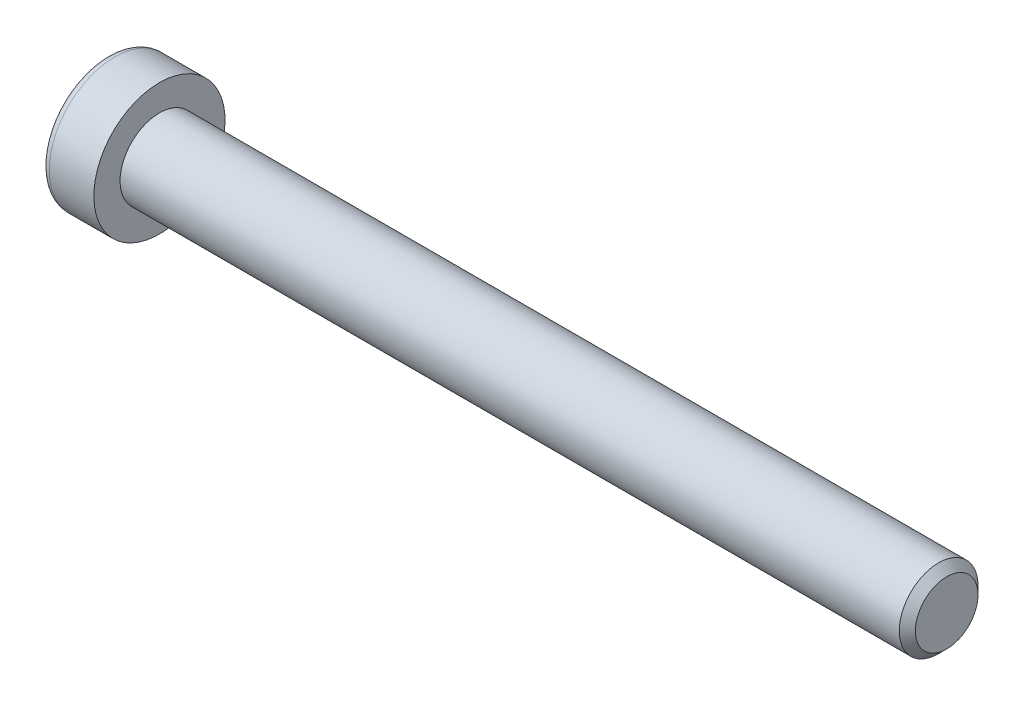
ISO-10303-21;
HEADER;
FILE_DESCRIPTION(('STEP AP214'),'2;1');
FILE_NAME('part.step','',(''),(''),'','','');
FILE_SCHEMA(('AUTOMOTIVE_DESIGN { 1 0 10303 214 1 1 1 1 }'));
ENDSEC;
DATA;
#1=APPLICATION_CONTEXT('core data for automotive mechanical design processes');
#2=APPLICATION_PROTOCOL_DEFINITION('international standard','automotive_design',2000,#1);
#3=PRODUCT_CONTEXT('',#1,'mechanical');
#4=PRODUCT('Part','Part','',(#3));
#5=PRODUCT_RELATED_PRODUCT_CATEGORY('part','',(#4));
#6=PRODUCT_DEFINITION_FORMATION('','',#4);
#7=PRODUCT_DEFINITION_CONTEXT('part definition',#1,'design');
#8=PRODUCT_DEFINITION('design','',#6,#7);
#9=PRODUCT_DEFINITION_SHAPE('','',#8);
#10=(LENGTH_UNIT() NAMED_UNIT(*) SI_UNIT(.MILLI.,.METRE.));
#11=(NAMED_UNIT(*) PLANE_ANGLE_UNIT() SI_UNIT($,.RADIAN.));
#12=(NAMED_UNIT(*) SI_UNIT($,.STERADIAN.) SOLID_ANGLE_UNIT());
#13=UNCERTAINTY_MEASURE_WITH_UNIT(LENGTH_MEASURE(1.E-05),#10,'distance_accuracy_value','');
#14=(GEOMETRIC_REPRESENTATION_CONTEXT(3) GLOBAL_UNCERTAINTY_ASSIGNED_CONTEXT((#13)) GLOBAL_UNIT_ASSIGNED_CONTEXT((#10,
#11,#12)) REPRESENTATION_CONTEXT('',''));
#15=CARTESIAN_POINT('',(0.,0.,0.));
#16=DIRECTION('',(0.,0.,1.));
#17=DIRECTION('',(1.,0.,0.));
#18=AXIS2_PLACEMENT_3D('',#15,#16,#17);
#19=CARTESIAN_POINT('',(-1.0080000013204,0.,0.));
#20=DIRECTION('',(-1.,0.,0.));
#21=DIRECTION('',(0.,0.,1.));
#22=AXIS2_PLACEMENT_3D('',#19,#20,#21);
#23=CONICAL_SURFACE('',#22,2.32325748231688,1.04719754987444);
#24=CARTESIAN_POINT('',(0.333333335277075,-1.13686837721616E-10,0.));
#25=VERTEX_POINT('',#24);
#26=VERTEX_LOOP('',#25);
#27=FACE_BOUND('',#26,.T.);
#28=CARTESIAN_POINT('',(-1.00000000147417,2.00000000033577,1.15470053795369));
#29=CARTESIAN_POINT('',(-0.970695546651424,2.00000000012059,1.05321634683343));
#30=CARTESIAN_POINT('',(-0.944044678605912,2.00000000003232,0.950856145634243));
#31=CARTESIAN_POINT('',(-0.89752638882102,1.9999999999676,0.744363444828041));
#32=CARTESIAN_POINT('',(-0.877675421693126,1.99999999999142,0.640227277439652));
#33=CARTESIAN_POINT('',(-0.846775960221252,2.00000000000837,0.433245449982703));
#34=CARTESIAN_POINT('',(-0.835521788855821,2.00000000000223,0.330431627800687));
#35=CARTESIAN_POINT('',(-0.822089169383493,1.99999999999777,0.124320462828436));
#36=CARTESIAN_POINT('',(-0.819899595237444,1.99999999999944,0.0210238686822163));
#37=CARTESIAN_POINT('',(-0.824466291464269,2.00000000000049,-0.171974735991148));
#38=CARTESIAN_POINT('',(-0.830101286550578,2.00000000000013,-0.261705707531802));
#39=CARTESIAN_POINT('',(-0.847957302108121,1.99999999999987,-0.440583082600117));
#40=CARTESIAN_POINT('',(-0.860184416189506,1.99999999999996,-0.529728867900473));
#41=CARTESIAN_POINT('',(-0.890749834827568,2.00000000000004,-0.70897474722998));
#42=CARTESIAN_POINT('',(-0.909217643745651,2.00000000000002,-0.799052166718215));
#43=CARTESIAN_POINT('',(-0.951131762446776,1.99999999999998,-0.977863889549757));
#44=CARTESIAN_POINT('',(-0.974568230401505,1.99999999999996,-1.06660048191082));
#45=CARTESIAN_POINT('',(-1.0000000016925,2.,-1.15470053794852));
#46=B_SPLINE_CURVE_WITH_KNOTS('',3,(#28,#29,#30,#31,#32,#33,#34,#35,#36,#37,#38,#39,#40,#41,#42,
#43,#44,#45),.UNSPECIFIED.,.F.,.F.,(4,2,2,2,2,2,2,2,4),(0.,0.317016011625951,0.634793817177001,
0.944707606346165,1.25424088912896,1.52370778261223,1.7934241935265,2.06912162198924,
2.3442779727795),.UNSPECIFIED.);
#47=CARTESIAN_POINT('',(-1.00000000167708,1.99999999979036,1.15470053825821));
#48=VERTEX_POINT('',#47);
#49=CARTESIAN_POINT('',(-1.00000000174696,2.,-1.15470053813718));
#50=VERTEX_POINT('',#49);
#51=EDGE_CURVE('E18',#48,#50,#46,.T.);
#52=ORIENTED_EDGE('',*,*,#51,.T.);
#53=CARTESIAN_POINT('',(-1.00000000147417,1.99999999979934,-1.15470053888282));
#54=CARTESIAN_POINT('',(-0.970695546651423,1.91211211209909,-1.2054426342566));
#55=CARTESIAN_POINT('',(-0.944044678605912,1.82346557747997,-1.25662273477975));
#56=CARTESIAN_POINT('',(-0.89752638882102,1.64463765285338,-1.3598690851268));
#57=CARTESIAN_POINT('',(-0.877675421693125,1.5544530864542,-1.41193716884162));
#58=CARTESIAN_POINT('',(-0.846775960221251,1.37520156576323,-1.51542808258477));
#59=CARTESIAN_POINT('',(-0.83552178885582,1.28616218389036,-1.56683499367046));
#60=CARTESIAN_POINT('',(-0.822089169383492,1.10766467901855,-1.66989057615273));
#61=CARTESIAN_POINT('',(-0.819899595237443,1.01820720436435,-1.72153887322728));
#62=CARTESIAN_POINT('',(-0.824466291464268,0.851065509822789,-1.81803817556487));
#63=CARTESIAN_POINT('',(-0.830101286550577,0.773356208962147,-1.86290366133489));
#64=CARTESIAN_POINT('',(-0.84795730210812,0.618443857990577,-1.95234234886882));
#65=CARTESIAN_POINT('',(-0.860184416189505,0.541241343280201,-1.99691524151908));
#66=CARTESIAN_POINT('',(-0.890749834827567,0.386009858257207,-2.0865381811839));
#67=CARTESIAN_POINT('',(-0.90921764374565,0.308000524673037,-2.131576890928));
#68=CARTESIAN_POINT('',(-0.951131762446774,0.153145030206441,-2.22098275234374));
#69=CARTESIAN_POINT('',(-0.974568230401503,0.0762968869764867,-2.26535104852425));
#70=CARTESIAN_POINT('',(-1.0000000016925,3.73024698366476E-10,-2.30940107654314));
#71=B_SPLINE_CURVE_WITH_KNOTS('',3,(#53,#54,#55,#56,#57,#58,#59,#60,#61,#62,#63,#64,#65,#66,#67,
#68,#69,#70),.UNSPECIFIED.,.F.,.F.,(4,2,2,2,2,2,2,2,4),(0.,0.317016011625951,0.634793817177,
0.944707606346164,1.25424088912896,1.52370778261223,1.7934241935265,2.06912162198924,
2.3442779727795),.UNSPECIFIED.);
#72=CARTESIAN_POINT('',(-1.00000000167708,0.,-2.30940107651643));
#73=VERTEX_POINT('',#72);
#74=EDGE_CURVE('E78',#50,#73,#71,.T.);
#75=ORIENTED_EDGE('',*,*,#74,.T.);
#76=CARTESIAN_POINT('',(-1.00000000147417,-5.3643055377186E-10,-2.30940107683651));
#77=CARTESIAN_POINT('',(-0.970695546651424,-0.0878878880215004,-2.25865898109003));
#78=CARTESIAN_POINT('',(-0.944044678605912,-0.176534422552348,-2.20747888041399));
#79=CARTESIAN_POINT('',(-0.89752638882102,-0.355362347114219,-2.10423252995484));
#80=CARTESIAN_POINT('',(-0.877675421693126,-0.445546913537223,-2.05216444628128));
#81=CARTESIAN_POINT('',(-0.846775960221251,-0.624798434245139,-1.94867353256747));
#82=CARTESIAN_POINT('',(-0.83552178885582,-0.713837816111874,-1.89726662147115));
#83=CARTESIAN_POINT('',(-0.822089169383492,-0.89233532097922,-1.79421103898117));
#84=CARTESIAN_POINT('',(-0.819899595237443,-0.981792795635091,-1.7425627419095));
#85=CARTESIAN_POINT('',(-0.824466291464268,-1.1489344901777,-1.64606343957373));
#86=CARTESIAN_POINT('',(-0.830101286550577,-1.22664379103798,-1.60119795380309));
#87=CARTESIAN_POINT('',(-0.84795730210812,-1.38155614200929,-1.51175926626871));
#88=CARTESIAN_POINT('',(-0.860184416189505,-1.45875865671976,-1.46718637361861));
#89=CARTESIAN_POINT('',(-0.890749834827567,-1.61399014174283,-1.37756343395392));
#90=CARTESIAN_POINT('',(-0.90921764374565,-1.69199947532698,-1.33252472420979));
#91=CARTESIAN_POINT('',(-0.951131762446775,-1.84685496979354,-1.24311886279398));
#92=CARTESIAN_POINT('',(-0.974568230401503,-1.92370311302347,-1.19875056661343));
#93=CARTESIAN_POINT('',(-1.0000000016925,-1.99999999962697,-1.15470053859462));
#94=B_SPLINE_CURVE_WITH_KNOTS('',3,(#76,#77,#78,#79,#80,#81,#82,#83,#84,#85,#86,#87,#88,#89,#90,
#91,#92,#93),.UNSPECIFIED.,.F.,.F.,(4,2,2,2,2,2,2,2,4),(0.,0.317016011625951,0.634793817177001,
0.944707606346165,1.25424088912896,1.52370778261223,1.7934241935265,2.06912162198924,
2.3442779727795),.UNSPECIFIED.);
#95=CARTESIAN_POINT('',(-1.00000000167708,-1.99999999979036,-1.15470053825822));
#96=VERTEX_POINT('',#95);
#97=EDGE_CURVE('E103',#73,#96,#94,.T.);
#98=ORIENTED_EDGE('',*,*,#97,.T.);
#99=CARTESIAN_POINT('',(-1.00000000147417,-2.00000000033577,-1.15470053795369));
#100=CARTESIAN_POINT('',(-0.970695546651424,-2.00000000012059,-1.05321634683343));
#101=CARTESIAN_POINT('',(-0.944044678605912,-2.00000000003232,-0.950856145634245));
#102=CARTESIAN_POINT('',(-0.89752638882102,-1.9999999999676,-0.744363444828043));
#103=CARTESIAN_POINT('',(-0.877675421693126,-1.99999999999142,-0.640227277439654));
#104=CARTESIAN_POINT('',(-0.846775960221251,-2.00000000000836,-0.433245449982705));
#105=CARTESIAN_POINT('',(-0.83552178885582,-2.00000000000223,-0.330431627800689));
#106=CARTESIAN_POINT('',(-0.822089169383492,-1.99999999999777,-0.124320462828438));
#107=CARTESIAN_POINT('',(-0.819899595237443,-1.99999999999944,-0.0210238686822187));
#108=CARTESIAN_POINT('',(-0.824466291464268,-2.00000000000049,0.171974735991145));
#109=CARTESIAN_POINT('',(-0.830101286550578,-2.00000000000013,0.261705707531799));
#110=CARTESIAN_POINT('',(-0.84795730210812,-1.99999999999987,0.440583082600114));
#111=CARTESIAN_POINT('',(-0.860184416189505,-1.99999999999996,0.529728867900471));
#112=CARTESIAN_POINT('',(-0.890749834827567,-2.00000000000004,0.708974747229978));
#113=CARTESIAN_POINT('',(-0.90921764374565,-2.00000000000002,0.799052166718213));
#114=CARTESIAN_POINT('',(-0.951131762446775,-1.99999999999998,0.977863889549755));
#115=CARTESIAN_POINT('',(-0.974568230401504,-1.99999999999996,1.06660048191082));
#116=CARTESIAN_POINT('',(-1.0000000016925,-2.,1.15470053794852));
#117=B_SPLINE_CURVE_WITH_KNOTS('',3,(#99,#100,#101,#102,#103,#104,#105,#106,#107,#108,#109,#110,
#111,#112,#113,#114,#115,#116),.UNSPECIFIED.,.F.,.F.,(4,2,2,2,2,2,2,2,4),(0.,0.317016011625951,
0.634793817177001,0.944707606346165,1.25424088912896,1.52370778261223,1.7934241935265,
2.06912162198924,2.3442779727795),.UNSPECIFIED.);
#118=CARTESIAN_POINT('',(-1.00000000167708,-1.99999999979036,1.15470053825822));
#119=VERTEX_POINT('',#118);
#120=EDGE_CURVE('E127',#96,#119,#117,.T.);
#121=ORIENTED_EDGE('',*,*,#120,.T.);
#122=CARTESIAN_POINT('',(-1.00000000147417,-1.99999999979934,1.15470053888282));
#123=CARTESIAN_POINT('',(-0.970695546651424,-1.91211211209909,1.2054426342566));
#124=CARTESIAN_POINT('',(-0.944044678605912,-1.82346557747997,1.25662273477974));
#125=CARTESIAN_POINT('',(-0.89752638882102,-1.64463765285338,1.3598690851268));
#126=CARTESIAN_POINT('',(-0.877675421693125,-1.5544530864542,1.41193716884162));
#127=CARTESIAN_POINT('',(-0.846775960221251,-1.37520156576323,1.51542808258477));
#128=CARTESIAN_POINT('',(-0.83552178885582,-1.28616218389036,1.56683499367046));
#129=CARTESIAN_POINT('',(-0.822089169383492,-1.10766467901855,1.66989057615273));
#130=CARTESIAN_POINT('',(-0.819899595237443,-1.01820720436435,1.72153887322728));
#131=CARTESIAN_POINT('',(-0.824466291464268,-0.85106550982279,1.81803817556487));
#132=CARTESIAN_POINT('',(-0.830101286550577,-0.773356208962147,1.86290366133489));
#133=CARTESIAN_POINT('',(-0.84795730210812,-0.618443857990578,1.95234234886882));
#134=CARTESIAN_POINT('',(-0.860184416189505,-0.541241343280202,1.99691524151908));
#135=CARTESIAN_POINT('',(-0.890749834827567,-0.386009858257207,2.0865381811839));
#136=CARTESIAN_POINT('',(-0.90921764374565,-0.308000524673038,2.131576890928));
#137=CARTESIAN_POINT('',(-0.951131762446775,-0.153145030206442,2.22098275234374));
#138=CARTESIAN_POINT('',(-0.974568230401503,-0.0762968869764879,2.26535104852425));
#139=CARTESIAN_POINT('',(-1.0000000016925,-3.73025682950192E-10,2.30940107654314));
#140=B_SPLINE_CURVE_WITH_KNOTS('',3,(#122,#123,#124,#125,#126,#127,#128,#129,#130,#131,#132,
#133,#134,#135,#136,#137,#138,#139),.UNSPECIFIED.,.F.,.F.,(4,2,2,2,2,2,2,2,4),(0.,
0.317016011625951,0.634793817177001,0.944707606346165,1.25424088912896,1.52370778261223,
1.7934241935265,2.06912162198924,2.3442779727795),.UNSPECIFIED.);
#141=CARTESIAN_POINT('',(-1.00000000167708,0.,2.30940107651643));
#142=VERTEX_POINT('',#141);
#143=EDGE_CURVE('E135',#119,#142,#140,.T.);
#144=ORIENTED_EDGE('',*,*,#143,.T.);
#145=CARTESIAN_POINT('',(-1.00000000147417,5.36430323683261E-10,2.30940107683651));
#146=CARTESIAN_POINT('',(-0.970695546651424,0.0878878880215003,2.25865898109003));
#147=CARTESIAN_POINT('',(-0.944044678605912,0.176534422552348,2.20747888041399));
#148=CARTESIAN_POINT('',(-0.89752638882102,0.355362347114218,2.10423252995484));
#149=CARTESIAN_POINT('',(-0.877675421693125,0.445546913537223,2.05216444628128));
#150=CARTESIAN_POINT('',(-0.846775960221251,0.624798434245139,1.94867353256747));
#151=CARTESIAN_POINT('',(-0.83552178885582,0.713837816111873,1.89726662147115));
#152=CARTESIAN_POINT('',(-0.822089169383491,0.892335320979219,1.79421103898117));
#153=CARTESIAN_POINT('',(-0.819899595237443,0.98179279563509,1.7425627419095));
#154=CARTESIAN_POINT('',(-0.824466291464268,1.1489344901777,1.64606343957372));
#155=CARTESIAN_POINT('',(-0.830101286550577,1.22664379103798,1.60119795380309));
#156=CARTESIAN_POINT('',(-0.847957302108119,1.38155614200929,1.5117592662687));
#157=CARTESIAN_POINT('',(-0.860184416189504,1.45875865671976,1.46718637361861));
#158=CARTESIAN_POINT('',(-0.890749834827566,1.61399014174283,1.37756343395392));
#159=CARTESIAN_POINT('',(-0.909217643745649,1.69199947532698,1.33252472420978));
#160=CARTESIAN_POINT('',(-0.951131762446774,1.84685496979354,1.24311886279398));
#161=CARTESIAN_POINT('',(-0.974568230401503,1.92370311302347,1.19875056661343));
#162=CARTESIAN_POINT('',(-1.0000000016925,1.99999999962697,1.15470053859461));
#163=B_SPLINE_CURVE_WITH_KNOTS('',3,(#145,#146,#147,#148,#149,#150,#151,#152,#153,#154,#155,
#156,#157,#158,#159,#160,#161,#162),.UNSPECIFIED.,.F.,.F.,(4,2,2,2,2,2,2,2,4),(0.,
0.317016011625951,0.634793817177001,0.944707606346165,1.25424088912896,1.52370778261223,
1.7934241935265,2.06912162198924,2.3442779727795),.UNSPECIFIED.);
#164=EDGE_CURVE('E80',#142,#48,#163,.T.);
#165=ORIENTED_EDGE('',*,*,#164,.T.);
#166=EDGE_LOOP('',(#52,#75,#98,#121,#144,#165));
#167=FACE_BOUND('',#166,.T.);
#168=ADVANCED_FACE('F14',(#27,#167),#23,.F.);
#169=CARTESIAN_POINT('',(-3.99999999999999,2.,1.15470053837925));
#170=DIRECTION('',(0.,1.,0.));
#171=DIRECTION('',(0.,0.,1.));
#172=AXIS2_PLACEMENT_3D('',#169,#170,#171);
#173=PLANE('',#172);
#174=DIRECTION('',(1.,0.,0.));
#175=VECTOR('',#174,1.);
#176=CARTESIAN_POINT('',(-3.99999999999999,2.,1.15470053837925));
#177=LINE('',#176,#175);
#178=CARTESIAN_POINT('',(-3.99999999999999,2.,1.15470053837925));
#179=VERTEX_POINT('',#178);
#180=EDGE_CURVE('E82',#48,#179,#177,.F.);
#181=ORIENTED_EDGE('',*,*,#180,.T.);
#182=DIRECTION('',(0.,0.,1.));
#183=VECTOR('',#182,1.);
#184=CARTESIAN_POINT('',(-3.99999999999999,2.,0.));
#185=LINE('',#184,#183);
#186=CARTESIAN_POINT('',(-3.99999999999999,2.,-1.15470053837925));
#187=VERTEX_POINT('',#186);
#188=EDGE_CURVE('E87',#187,#179,#185,.T.);
#189=ORIENTED_EDGE('',*,*,#188,.F.);
#190=DIRECTION('',(1.,0.,0.));
#191=VECTOR('',#190,1.);
#192=CARTESIAN_POINT('',(-3.99999999999999,2.,-1.15470053837925));
#193=LINE('',#192,#191);
#194=EDGE_CURVE('E85',#187,#50,#193,.T.);
#195=ORIENTED_EDGE('',*,*,#194,.T.);
#196=ORIENTED_EDGE('',*,*,#51,.F.);
#197=EDGE_LOOP('',(#181,#189,#195,#196));
#198=FACE_BOUND('',#197,.T.);
#199=ADVANCED_FACE('F74',(#198),#173,.F.);
#200=CARTESIAN_POINT('',(-3.99999999999999,0.,2.3094010767585));
#201=DIRECTION('',(0.,0.500000000000001,0.866025403784438));
#202=DIRECTION('',(0.,-0.866025403784438,0.500000000000001));
#203=AXIS2_PLACEMENT_3D('',#200,#201,#202);
#204=PLANE('',#203);
#205=DIRECTION('',(1.,0.,0.));
#206=VECTOR('',#205,1.);
#207=CARTESIAN_POINT('',(-3.99999999999999,0.,2.3094010767585));
#208=LINE('',#207,#206);
#209=CARTESIAN_POINT('',(-3.99999999999999,0.,2.3094010767585));
#210=VERTEX_POINT('',#209);
#211=EDGE_CURVE('E139',#142,#210,#208,.F.);
#212=ORIENTED_EDGE('',*,*,#211,.T.);
#213=DIRECTION('',(0.,-0.866025403784438,0.500000000000001));
#214=VECTOR('',#213,1.);
#215=CARTESIAN_POINT('',(-3.99999999999999,2.,1.15470053837925));
#216=LINE('',#215,#214);
#217=EDGE_CURVE('E93',#179,#210,#216,.T.);
#218=ORIENTED_EDGE('',*,*,#217,.F.);
#219=ORIENTED_EDGE('',*,*,#180,.F.);
#220=ORIENTED_EDGE('',*,*,#164,.F.);
#221=EDGE_LOOP('',(#212,#218,#219,#220));
#222=FACE_BOUND('',#221,.T.);
#223=ADVANCED_FACE('F143',(#222),#204,.F.);
#224=CARTESIAN_POINT('',(-3.99999999999999,-2.,1.15470053837925));
#225=DIRECTION('',(0.,-0.5,0.866025403784439));
#226=DIRECTION('',(0.,-0.866025403784439,-0.5));
#227=AXIS2_PLACEMENT_3D('',#224,#225,#226);
#228=PLANE('',#227);
#229=DIRECTION('',(1.,0.,0.));
#230=VECTOR('',#229,1.);
#231=CARTESIAN_POINT('',(-3.99999999999999,-2.,1.15470053837925));
#232=LINE('',#231,#230);
#233=CARTESIAN_POINT('',(-3.99999999999999,-2.,1.15470053837925));
#234=VERTEX_POINT('',#233);
#235=EDGE_CURVE('E134',#119,#234,#232,.F.);
#236=ORIENTED_EDGE('',*,*,#235,.T.);
#237=DIRECTION('',(0.,-0.866025403784439,-0.5));
#238=VECTOR('',#237,1.);
#239=CARTESIAN_POINT('',(-3.99999999999999,0.,2.3094010767585));
#240=LINE('',#239,#238);
#241=EDGE_CURVE('E222',#210,#234,#240,.T.);
#242=ORIENTED_EDGE('',*,*,#241,.F.);
#243=ORIENTED_EDGE('',*,*,#211,.F.);
#244=ORIENTED_EDGE('',*,*,#143,.F.);
#245=EDGE_LOOP('',(#236,#242,#243,#244));
#246=FACE_BOUND('',#245,.T.);
#247=ADVANCED_FACE('F123',(#246),#228,.F.);
#248=CARTESIAN_POINT('',(-3.99999999999999,-2.,-1.15470053837925));
#249=DIRECTION('',(0.,-1.,0.));
#250=DIRECTION('',(0.,0.,-1.));
#251=AXIS2_PLACEMENT_3D('',#248,#249,#250);
#252=PLANE('',#251);
#253=DIRECTION('',(1.,0.,0.));
#254=VECTOR('',#253,1.);
#255=CARTESIAN_POINT('',(-3.99999999999999,-2.,-1.15470053837925));
#256=LINE('',#255,#254);
#257=CARTESIAN_POINT('',(-3.99999999999999,-2.,-1.15470053837925));
#258=VERTEX_POINT('',#257);
#259=EDGE_CURVE('E133',#96,#258,#256,.F.);
#260=ORIENTED_EDGE('',*,*,#259,.T.);
#261=DIRECTION('',(0.,0.,1.));
#262=VECTOR('',#261,1.);
#263=CARTESIAN_POINT('',(-3.99999999999999,-2.,0.));
#264=LINE('',#263,#262);
#265=EDGE_CURVE('E219',#234,#258,#264,.F.);
#266=ORIENTED_EDGE('',*,*,#265,.F.);
#267=ORIENTED_EDGE('',*,*,#235,.F.);
#268=ORIENTED_EDGE('',*,*,#120,.F.);
#269=EDGE_LOOP('',(#260,#266,#267,#268));
#270=FACE_BOUND('',#269,.T.);
#271=ADVANCED_FACE('F119',(#270),#252,.F.);
#272=CARTESIAN_POINT('',(-3.99999999999999,0.,-2.3094010767585));
#273=DIRECTION('',(0.,-0.5,-0.866025403784438));
#274=DIRECTION('',(0.,0.866025403784438,-0.5));
#275=AXIS2_PLACEMENT_3D('',#272,#273,#274);
#276=PLANE('',#275);
#277=DIRECTION('',(1.,0.,0.));
#278=VECTOR('',#277,1.);
#279=CARTESIAN_POINT('',(-3.99999999999999,0.,-2.3094010767585));
#280=LINE('',#279,#278);
#281=CARTESIAN_POINT('',(-3.99999999999999,0.,-2.3094010767585));
#282=VERTEX_POINT('',#281);
#283=EDGE_CURVE('E36',#73,#282,#280,.F.);
#284=ORIENTED_EDGE('',*,*,#283,.T.);
#285=DIRECTION('',(0.,0.866025403784438,-0.5));
#286=VECTOR('',#285,1.);
#287=CARTESIAN_POINT('',(-3.99999999999999,-2.,-1.15470053837925));
#288=LINE('',#287,#286);
#289=EDGE_CURVE('E216',#258,#282,#288,.T.);
#290=ORIENTED_EDGE('',*,*,#289,.F.);
#291=ORIENTED_EDGE('',*,*,#259,.F.);
#292=ORIENTED_EDGE('',*,*,#97,.F.);
#293=EDGE_LOOP('',(#284,#290,#291,#292));
#294=FACE_BOUND('',#293,.T.);
#295=ADVANCED_FACE('F113',(#294),#276,.F.);
#296=CARTESIAN_POINT('',(-3.99999999999999,2.,-1.15470053837925));
#297=DIRECTION('',(0.,0.5,-0.866025403784439));
#298=DIRECTION('',(0.,0.866025403784439,0.5));
#299=AXIS2_PLACEMENT_3D('',#296,#297,#298);
#300=PLANE('',#299);
#301=ORIENTED_EDGE('',*,*,#194,.F.);
#302=DIRECTION('',(0.,0.866025403784439,0.5));
#303=VECTOR('',#302,1.);
#304=CARTESIAN_POINT('',(-3.99999999999999,0.,-2.3094010767585));
#305=LINE('',#304,#303);
#306=EDGE_CURVE('E214',#282,#187,#305,.T.);
#307=ORIENTED_EDGE('',*,*,#306,.F.);
#308=ORIENTED_EDGE('',*,*,#283,.F.);
#309=ORIENTED_EDGE('',*,*,#74,.F.);
#310=EDGE_LOOP('',(#301,#307,#308,#309));
#311=FACE_BOUND('',#310,.T.);
#312=ADVANCED_FACE('F91',(#311),#300,.F.);
#313=CARTESIAN_POINT('',(-3.99999999999999,3.65470053837925,0.));
#314=DIRECTION('',(-1.,0.,0.));
#315=DIRECTION('',(0.,0.,1.));
#316=AXIS2_PLACEMENT_3D('',#313,#314,#315);
#317=PLANE('',#316);
#318=ORIENTED_EDGE('',*,*,#289,.T.);
#319=ORIENTED_EDGE('',*,*,#306,.T.);
#320=ORIENTED_EDGE('',*,*,#188,.T.);
#321=ORIENTED_EDGE('',*,*,#217,.T.);
#322=ORIENTED_EDGE('',*,*,#241,.T.);
#323=ORIENTED_EDGE('',*,*,#265,.T.);
#324=EDGE_LOOP('',(#318,#319,#320,#321,#322,#323));
#325=FACE_BOUND('',#324,.T.);
#326=CARTESIAN_POINT('',(-3.99999999999999,0.,0.));
#327=DIRECTION('',(1.,0.,0.));
#328=DIRECTION('',(0.,1.,0.));
#329=AXIS2_PLACEMENT_3D('',#326,#327,#328);
#330=CIRCLE('',#329,4.4);
#331=CARTESIAN_POINT('',(-3.99999999999999,4.4,0.));
#332=VERTEX_POINT('',#331);
#333=EDGE_CURVE('E191',#332,#332,#330,.T.);
#334=ORIENTED_EDGE('',*,*,#333,.F.);
#335=EDGE_LOOP('',(#334));
#336=FACE_BOUND('',#335,.T.);
#337=ADVANCED_FACE('F112',(#325,#336),#317,.T.);
#338=CARTESIAN_POINT('',(-3.4,0.,0.));
#339=DIRECTION('',(1.,0.,0.));
#340=DIRECTION('',(0.,0.,-1.));
#341=AXIS2_PLACEMENT_3D('',#338,#339,#340);
#342=TOROIDAL_SURFACE('',#341,4.4,0.6);
#343=CARTESIAN_POINT('',(-3.4,0.,0.));
#344=DIRECTION('',(1.,0.,0.));
#345=DIRECTION('',(0.,1.,0.));
#346=AXIS2_PLACEMENT_3D('',#343,#344,#345);
#347=CIRCLE('',#346,5.);
#348=CARTESIAN_POINT('',(-3.4,5.,0.));
#349=VERTEX_POINT('',#348);
#350=EDGE_CURVE('E232',#349,#349,#347,.T.);
#351=ORIENTED_EDGE('',*,*,#350,.F.);
#352=EDGE_LOOP('',(#351));
#353=FACE_BOUND('',#352,.T.);
#354=ORIENTED_EDGE('',*,*,#333,.T.);
#355=EDGE_LOOP('',(#354));
#356=FACE_BOUND('',#355,.T.);
#357=ADVANCED_FACE('F175',(#353,#356),#342,.T.);
#358=CARTESIAN_POINT('',(-1.99999999999999,0.,0.));
#359=DIRECTION('',(1.,0.,0.));
#360=DIRECTION('',(0.,1.,0.));
#361=AXIS2_PLACEMENT_3D('',#358,#359,#360);
#362=CYLINDRICAL_SURFACE('',#361,5.);
#363=ORIENTED_EDGE('',*,*,#350,.T.);
#364=EDGE_LOOP('',(#363));
#365=FACE_BOUND('',#364,.T.);
#366=CARTESIAN_POINT('',(0.,0.,0.));
#367=DIRECTION('',(1.,0.,0.));
#368=DIRECTION('',(0.,1.,0.));
#369=AXIS2_PLACEMENT_3D('',#366,#367,#368);
#370=CIRCLE('',#369,5.);
#371=CARTESIAN_POINT('',(0.,5.,0.));
#372=VERTEX_POINT('',#371);
#373=EDGE_CURVE('E101',#372,#372,#370,.T.);
#374=ORIENTED_EDGE('',*,*,#373,.F.);
#375=EDGE_LOOP('',(#374));
#376=FACE_BOUND('',#375,.T.);
#377=ADVANCED_FACE('F172',(#365,#376),#362,.T.);
#378=CARTESIAN_POINT('',(60.,1.5,0.));
#379=DIRECTION('',(1.,0.,0.));
#380=DIRECTION('',(0.,0.,-1.));
#381=AXIS2_PLACEMENT_3D('',#378,#379,#380);
#382=PLANE('',#381);
#383=CARTESIAN_POINT('',(60.0000000002296,0.,0.));
#384=DIRECTION('',(-1.,0.,0.));
#385=DIRECTION('',(0.,0.,1.));
#386=AXIS2_PLACEMENT_3D('',#383,#384,#385);
#387=CIRCLE('',#386,2.38655000026711);
#388=CARTESIAN_POINT('',(60.0000000002296,0.,2.38655000026711));
#389=VERTEX_POINT('',#388);
#390=EDGE_CURVE('E228',#389,#389,#387,.T.);
#391=ORIENTED_EDGE('',*,*,#390,.F.);
#392=EDGE_LOOP('',(#391));
#393=FACE_BOUND('',#392,.T.);
#394=ADVANCED_FACE('F168',(#393),#382,.T.);
#395=CARTESIAN_POINT('',(0.,4.,0.));
#396=DIRECTION('',(1.,0.,0.));
#397=DIRECTION('',(0.,0.,-1.));
#398=AXIS2_PLACEMENT_3D('',#395,#396,#397);
#399=PLANE('',#398);
#400=CARTESIAN_POINT('',(0.,0.,0.));
#401=DIRECTION('',(1.,0.,0.));
#402=DIRECTION('',(0.,1.,0.));
#403=AXIS2_PLACEMENT_3D('',#400,#401,#402);
#404=CIRCLE('',#403,3.);
#405=CARTESIAN_POINT('',(0.,3.,0.));
#406=VERTEX_POINT('',#405);
#407=EDGE_CURVE('E27',#406,#406,#404,.T.);
#408=ORIENTED_EDGE('',*,*,#407,.F.);
#409=EDGE_LOOP('',(#408));
#410=FACE_BOUND('',#409,.T.);
#411=ORIENTED_EDGE('',*,*,#373,.T.);
#412=EDGE_LOOP('',(#411));
#413=FACE_BOUND('',#412,.T.);
#414=ADVANCED_FACE('F161',(#410,#413),#399,.T.);
#415=CARTESIAN_POINT('',(59.386549999715,0.,0.));
#416=DIRECTION('',(-1.,0.,0.));
#417=DIRECTION('',(0.,0.,1.));
#418=AXIS2_PLACEMENT_3D('',#415,#416,#417);
#419=CONICAL_SURFACE('',#418,2.99999999970169,0.785398162517161);
#420=ORIENTED_EDGE('',*,*,#390,.T.);
#421=EDGE_LOOP('',(#420));
#422=FACE_BOUND('',#421,.T.);
#423=CARTESIAN_POINT('',(59.38655,0.,0.));
#424=DIRECTION('',(1.,0.,0.));
#425=DIRECTION('',(0.,1.,0.));
#426=AXIS2_PLACEMENT_3D('',#423,#424,#425);
#427=CIRCLE('',#426,3.);
#428=CARTESIAN_POINT('',(59.38655,3.,0.));
#429=VERTEX_POINT('',#428);
#430=EDGE_CURVE('E9',#429,#429,#427,.F.);
#431=ORIENTED_EDGE('',*,*,#430,.F.);
#432=EDGE_LOOP('',(#431));
#433=FACE_BOUND('',#432,.T.);
#434=ADVANCED_FACE('F154',(#422,#433),#419,.T.);
#435=CARTESIAN_POINT('',(51.,0.,0.));
#436=DIRECTION('',(1.,0.,0.));
#437=DIRECTION('',(0.,1.,0.));
#438=AXIS2_PLACEMENT_3D('',#435,#436,#437);
#439=CYLINDRICAL_SURFACE('',#438,3.);
#440=ORIENTED_EDGE('',*,*,#430,.T.);
#441=EDGE_LOOP('',(#440));
#442=FACE_BOUND('',#441,.T.);
#443=ORIENTED_EDGE('',*,*,#407,.T.);
#444=EDGE_LOOP('',(#443));
#445=FACE_BOUND('',#444,.T.);
#446=ADVANCED_FACE('F152',(#442,#445),#439,.T.);
#447=CLOSED_SHELL('',(#168,#199,#223,#247,#271,#295,#312,#337,#357,#377,#394,#414,#434,#446));
#448=MANIFOLD_SOLID_BREP('B1',#447);
#449=ADVANCED_BREP_SHAPE_REPRESENTATION('',(#18,#448),#14);
#450=SHAPE_DEFINITION_REPRESENTATION(#9,#449);
ENDSEC;
END-ISO-10303-21;
